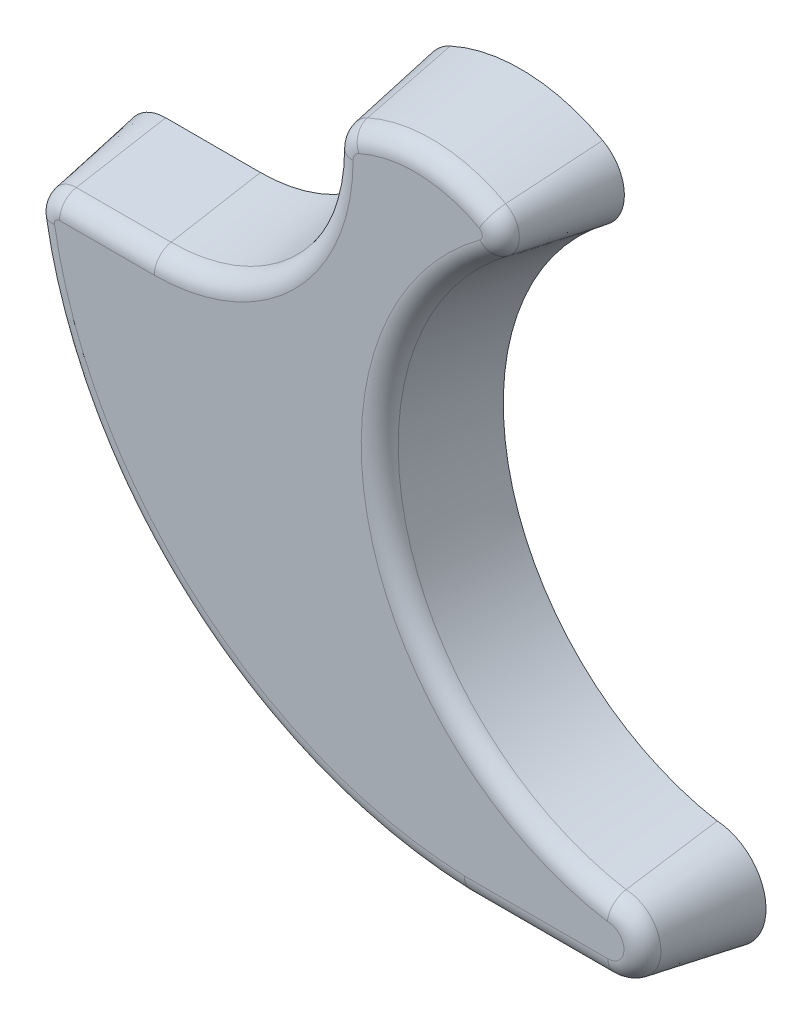
ISO-10303-21;
HEADER;
FILE_DESCRIPTION(('STEP AP214'),'2;1');
FILE_NAME('part.step','',(''),(''),'','','');
FILE_SCHEMA(('AUTOMOTIVE_DESIGN { 1 0 10303 214 1 1 1 1 }'));
ENDSEC;
DATA;
#1=APPLICATION_CONTEXT('core data for automotive mechanical design processes');
#2=APPLICATION_PROTOCOL_DEFINITION('international standard','automotive_design',2000,#1);
#3=PRODUCT_CONTEXT('',#1,'mechanical');
#4=PRODUCT('Part','Part','',(#3));
#5=PRODUCT_RELATED_PRODUCT_CATEGORY('part','',(#4));
#6=PRODUCT_DEFINITION_FORMATION('','',#4);
#7=PRODUCT_DEFINITION_CONTEXT('part definition',#1,'design');
#8=PRODUCT_DEFINITION('design','',#6,#7);
#9=PRODUCT_DEFINITION_SHAPE('','',#8);
#10=(LENGTH_UNIT() NAMED_UNIT(*) SI_UNIT(.MILLI.,.METRE.));
#11=(NAMED_UNIT(*) PLANE_ANGLE_UNIT() SI_UNIT($,.RADIAN.));
#12=(NAMED_UNIT(*) SI_UNIT($,.STERADIAN.) SOLID_ANGLE_UNIT());
#13=UNCERTAINTY_MEASURE_WITH_UNIT(LENGTH_MEASURE(1.E-05),#10,'distance_accuracy_value','');
#14=(GEOMETRIC_REPRESENTATION_CONTEXT(3) GLOBAL_UNCERTAINTY_ASSIGNED_CONTEXT((#13)) GLOBAL_UNIT_ASSIGNED_CONTEXT((#10,
#11,#12)) REPRESENTATION_CONTEXT('',''));
#15=CARTESIAN_POINT('',(0.,0.,0.));
#16=DIRECTION('',(0.,0.,1.));
#17=DIRECTION('',(1.,0.,0.));
#18=AXIS2_PLACEMENT_3D('',#15,#16,#17);
#19=CARTESIAN_POINT('',(-185.360620238029,11.7361066888979,0.));
#20=DIRECTION('',(0.,0.,-1.));
#21=DIRECTION('',(1.,0.,0.));
#22=AXIS2_PLACEMENT_3D('',#19,#20,#21);
#23=CONICAL_SURFACE('',#22,12.7,0.174532925199433);
#24=DIRECTION('',(-0.171170743391447,-0.0292278328629598,-0.984807753012208));
#25=VECTOR('',#24,1.);
#26=CARTESIAN_POINT('',(-197.879429650708,9.59848864794411,0.));
#27=LINE('',#26,#25);
#28=CARTESIAN_POINT('',(-193.052225703188,10.4227458041505,27.772665928185));
#29=VERTEX_POINT('',#28);
#30=CARTESIAN_POINT('',(-197.879429650708,9.59848864794409,0.));
#31=VERTEX_POINT('',#30);
#32=EDGE_CURVE('E157',#29,#31,#27,.T.);
#33=ORIENTED_EDGE('',*,*,#32,.F.);
#34=CARTESIAN_POINT('',(-185.360620238029,11.7361066888979,27.772665928185));
#35=DIRECTION('',(0.,0.,-1.));
#36=DIRECTION('',(-1.,0.,0.));
#37=AXIS2_PLACEMENT_3D('',#34,#35,#36);
#38=CIRCLE('',#37,7.80292967065828);
#39=CARTESIAN_POINT('',(-185.360620238029,19.5390363595562,27.772665928185));
#40=VERTEX_POINT('',#39);
#41=EDGE_CURVE('E56',#29,#40,#38,.T.);
#42=ORIENTED_EDGE('',*,*,#41,.T.);
#43=DIRECTION('',(0.,0.17364817766693,-0.984807753012208));
#44=VECTOR('',#43,1.);
#45=CARTESIAN_POINT('',(-185.360620238029,24.4361066888979,0.));
#46=LINE('',#45,#44);
#47=CARTESIAN_POINT('',(-185.360620238029,24.4361066888979,0.));
#48=VERTEX_POINT('',#47);
#49=EDGE_CURVE('E178',#40,#48,#46,.T.);
#50=ORIENTED_EDGE('',*,*,#49,.T.);
#51=CARTESIAN_POINT('',(-185.360620238029,11.7361066888979,0.));
#52=DIRECTION('',(0.,0.,1.));
#53=DIRECTION('',(1.,0.,0.));
#54=AXIS2_PLACEMENT_3D('',#51,#52,#53);
#55=CIRCLE('',#54,12.7);
#56=EDGE_CURVE('E172',#48,#31,#55,.T.);
#57=ORIENTED_EDGE('',*,*,#56,.T.);
#58=EDGE_LOOP('',(#33,#42,#50,#57));
#59=FACE_BOUND('',#58,.T.);
#60=ADVANCED_FACE('F46',(#59),#23,.T.);
#61=CARTESIAN_POINT('',(-54.3378571428572,34.1085714285715,0.));
#62=DIRECTION('',(0.,0.,-1.));
#63=DIRECTION('',(1.,0.,0.));
#64=AXIS2_PLACEMENT_3D('',#61,#62,#63);
#65=CONICAL_SURFACE('',#64,145.619116862931,0.174532925199433);
#66=CARTESIAN_POINT('',(-59.5693856344838,-105.59030612125,33.02));
#67=CARTESIAN_POINT('',(-59.5875471806484,-106.560692169269,27.5166672478581));
#68=CARTESIAN_POINT('',(-59.6056170011073,-107.531078268531,22.0133342051054));
#69=CARTESIAN_POINT('',(-59.6415731906139,-109.471850569529,11.0066675384387));
#70=CARTESIAN_POINT('',(-59.6594595596615,-110.442236771265,5.50333391452478));
#71=CARTESIAN_POINT('',(-59.6772542030036,-111.412623024244,0.));
#72=B_SPLINE_CURVE_WITH_KNOTS('',3,(#66,#67,#68,#69,#70,#71),.UNSPECIFIED.,.F.,.F.,(4,2,4),(0.,
16.7647801213005,33.5295602424167),.UNSPECIFIED.);
#73=CARTESIAN_POINT('',(-59.5866755915734,-106.515552694902,27.772665928185));
#74=VERTEX_POINT('',#73);
#75=CARTESIAN_POINT('',(-59.6772542030037,-111.412623024244,0.));
#76=VERTEX_POINT('',#75);
#77=EDGE_CURVE('E166',#74,#76,#72,.T.);
#78=ORIENTED_EDGE('',*,*,#77,.F.);
#79=CARTESIAN_POINT('',(-54.3378571428572,34.1085714285715,27.772665928185));
#80=DIRECTION('',(0.,0.,-1.));
#81=DIRECTION('',(-1.,0.,0.));
#82=AXIS2_PLACEMENT_3D('',#79,#80,#81);
#83=CIRCLE('',#82,140.722046533589);
#84=EDGE_CURVE('E64',#74,#29,#83,.T.);
#85=ORIENTED_EDGE('',*,*,#84,.T.);
#86=ORIENTED_EDGE('',*,*,#32,.T.);
#87=CARTESIAN_POINT('',(-54.3378571428572,34.1085714285715,0.));
#88=DIRECTION('',(0.,0.,1.));
#89=DIRECTION('',(1.,0.,0.));
#90=AXIS2_PLACEMENT_3D('',#87,#88,#89);
#91=CIRCLE('',#90,145.619116862931);
#92=EDGE_CURVE('E160',#31,#76,#91,.T.);
#93=ORIENTED_EDGE('',*,*,#92,.T.);
#94=EDGE_LOOP('',(#78,#85,#86,#93));
#95=FACE_BOUND('',#94,.T.);
#96=ADVANCED_FACE('F159',(#95),#65,.T.);
#97=CARTESIAN_POINT('',(-14.8204641625524,-111.412623024244,0.));
#98=DIRECTION('',(0.,-0.984807753012208,0.17364817766693));
#99=DIRECTION('',(0.,-0.17364817766693,-0.984807753012208));
#100=AXIS2_PLACEMENT_3D('',#97,#98,#99);
#101=PLANE('',#100);
#102=DIRECTION('',(0.,-0.17364817766693,-0.984807753012208));
#103=VECTOR('',#102,1.);
#104=CARTESIAN_POINT('',(-14.8204641625524,-111.412623024244,0.));
#105=LINE('',#104,#103);
#106=CARTESIAN_POINT('',(-14.8204641625524,-106.515552694902,27.772665928185));
#107=VERTEX_POINT('',#106);
#108=CARTESIAN_POINT('',(-14.8204641625524,-111.412623024244,0.));
#109=VERTEX_POINT('',#108);
#110=EDGE_CURVE('E451',#107,#109,#105,.T.);
#111=ORIENTED_EDGE('',*,*,#110,.F.);
#112=DIRECTION('',(1.,0.,0.));
#113=VECTOR('',#112,1.);
#114=CARTESIAN_POINT('',(-59.5693856344838,-106.515552694902,27.772665928185));
#115=LINE('',#114,#113);
#116=EDGE_CURVE('E72',#107,#74,#115,.F.);
#117=ORIENTED_EDGE('',*,*,#116,.T.);
#118=ORIENTED_EDGE('',*,*,#77,.T.);
#119=DIRECTION('',(1.,0.,0.));
#120=VECTOR('',#119,1.);
#121=CARTESIAN_POINT('',(-14.8204641625524,-111.412623024244,0.));
#122=LINE('',#121,#120);
#123=EDGE_CURVE('E175',#76,#109,#122,.T.);
#124=ORIENTED_EDGE('',*,*,#123,.T.);
#125=EDGE_LOOP('',(#111,#117,#118,#124));
#126=FACE_BOUND('',#125,.T.);
#127=ADVANCED_FACE('F402',(#126),#101,.T.);
#128=CARTESIAN_POINT('',(-14.8204641625524,-95.2797373334966,0.));
#129=DIRECTION('',(0.,0.,-1.));
#130=DIRECTION('',(1.,0.,0.));
#131=AXIS2_PLACEMENT_3D('',#128,#129,#130);
#132=CONICAL_SURFACE('',#131,16.1328856907471,0.174532925199433);
#133=CARTESIAN_POINT('',(-14.5084201854811,-84.9738915514478,33.02));
#134=CARTESIAN_POINT('',(-14.4576699848428,-84.4667315076806,30.1363427169767));
#135=CARTESIAN_POINT('',(-14.4055154966712,-83.9597875854176,27.2526724951651));
#136=CARTESIAN_POINT('',(-14.298771530745,-82.946275030161,21.4853126478576));
#137=CARTESIAN_POINT('',(-14.2441820542456,-82.4397063969741,18.6016230223724));
#138=CARTESIAN_POINT('',(-14.1380346976066,-81.4732580751137,13.0982834606489));
#139=CARTESIAN_POINT('',(-14.0866569393928,-81.0133506172318,10.4786349139742));
#140=CARTESIAN_POINT('',(-13.9823836772579,-80.093769615867,5.23932569271442));
#141=CARTESIAN_POINT('',(-13.9294881726286,-79.6340960724934,2.61966501812434));
#142=CARTESIAN_POINT('',(-13.8759255527134,-79.1745255210044,0.));
#143=B_SPLINE_CURVE_WITH_KNOTS('',3,(#133,#134,#135,#136,#137,#138,#139,#140,#141,#142),
.UNSPECIFIED.,.F.,.F.,(4,2,2,2,4),(0.,8.78506579771062,17.5701270661008,25.5507542714873,
33.5313852005815),.UNSPECIFIED.);
#144=CARTESIAN_POINT('',(-14.414570908634,-84.0512558020502,27.772665928185));
#145=VERTEX_POINT('',#144);
#146=CARTESIAN_POINT('',(-13.8759255527136,-79.1745255210044,0.));
#147=VERTEX_POINT('',#146);
#148=EDGE_CURVE('E448',#145,#147,#143,.T.);
#149=ORIENTED_EDGE('',*,*,#148,.F.);
#150=CARTESIAN_POINT('',(-14.8204641625524,-95.2797373334966,27.772665928185));
#151=DIRECTION('',(0.,0.,-1.));
#152=DIRECTION('',(-1.,0.,0.));
#153=AXIS2_PLACEMENT_3D('',#150,#151,#152);
#154=CIRCLE('',#153,11.2358153614054);
#155=EDGE_CURVE('E302',#145,#107,#154,.T.);
#156=ORIENTED_EDGE('',*,*,#155,.T.);
#157=ORIENTED_EDGE('',*,*,#110,.T.);
#158=CARTESIAN_POINT('',(-14.8204641625524,-95.2797373334966,0.));
#159=DIRECTION('',(0.,0.,1.));
#160=DIRECTION('',(1.,0.,0.));
#161=AXIS2_PLACEMENT_3D('',#158,#159,#160);
#162=CIRCLE('',#161,16.1328856907471);
#163=EDGE_CURVE('E186',#109,#147,#162,.T.);
#164=ORIENTED_EDGE('',*,*,#163,.T.);
#165=EDGE_LOOP('',(#149,#156,#157,#164));
#166=FACE_BOUND('',#165,.T.);
#167=ADVANCED_FACE('F427',(#166),#132,.T.);
#168=CARTESIAN_POINT('',(0.,0.,0.));
#169=DIRECTION('',(0.,0.,1.));
#170=DIRECTION('',(1.,0.,0.));
#171=AXIS2_PLACEMENT_3D('',#168,#169,#170);
#172=CONICAL_SURFACE('',#171,80.3812590186333,0.174532925199433);
#173=DIRECTION('',(0.103597979577627,-0.139359779830765,-0.984807753012208));
#174=VECTOR('',#173,1.);
#175=CARTESIAN_POINT('',(-47.9552169341434,64.5092549191189,0.));
#176=LINE('',#175,#174);
#177=CARTESIAN_POINT('',(-50.8767943372904,68.4393545728096,27.772665928185));
#178=VERTEX_POINT('',#177);
#179=CARTESIAN_POINT('',(-47.9552169341434,64.5092549191189,0.));
#180=VERTEX_POINT('',#179);
#181=EDGE_CURVE('E437',#178,#180,#176,.T.);
#182=ORIENTED_EDGE('',*,*,#181,.F.);
#183=CARTESIAN_POINT('',(0.,0.,27.772665928185));
#184=DIRECTION('',(0.,0.,1.));
#185=DIRECTION('',(1.,0.,0.));
#186=AXIS2_PLACEMENT_3D('',#183,#184,#185);
#187=CIRCLE('',#186,85.2783293479751);
#188=EDGE_CURVE('E294',#178,#145,#187,.T.);
#189=ORIENTED_EDGE('',*,*,#188,.T.);
#190=ORIENTED_EDGE('',*,*,#148,.T.);
#191=CARTESIAN_POINT('',(0.,0.,0.));
#192=DIRECTION('',(0.,0.,-1.));
#193=DIRECTION('',(1.,0.,0.));
#194=AXIS2_PLACEMENT_3D('',#191,#192,#193);
#195=CIRCLE('',#194,80.3812590186333);
#196=EDGE_CURVE('E189',#147,#180,#195,.T.);
#197=ORIENTED_EDGE('',*,*,#196,.T.);
#198=EDGE_LOOP('',(#182,#189,#190,#197));
#199=FACE_BOUND('',#198,.T.);
#200=ADVANCED_FACE('F422',(#199),#172,.F.);
#201=CARTESIAN_POINT('',(-55.6835343025102,74.9053708598825,0.));
#202=DIRECTION('',(0.,0.,-1.));
#203=DIRECTION('',(1.,0.,0.));
#204=AXIS2_PLACEMENT_3D('',#201,#202,#203);
#205=CONICAL_SURFACE('',#204,12.954,0.174532925199433);
#206=DIRECTION('',(0.083292428567465,0.152368175648262,-0.984807753012208));
#207=VECTOR('',#206,1.);
#208=CARTESIAN_POINT('',(-49.4699930252013,86.2719015880853,0.));
#209=LINE('',#208,#207);
#210=CARTESIAN_POINT('',(-51.8189314711832,81.9749508102072,27.772665928185));
#211=VERTEX_POINT('',#210);
#212=CARTESIAN_POINT('',(-49.4699930252013,86.2719015880853,0.));
#213=VERTEX_POINT('',#212);
#214=EDGE_CURVE('E430',#211,#213,#209,.T.);
#215=ORIENTED_EDGE('',*,*,#214,.F.);
#216=CARTESIAN_POINT('',(-55.6835343025102,74.9053708598825,27.772665928185));
#217=DIRECTION('',(0.,0.,-1.));
#218=DIRECTION('',(-1.,0.,0.));
#219=AXIS2_PLACEMENT_3D('',#216,#217,#218);
#220=CIRCLE('',#219,8.05692967065828);
#221=EDGE_CURVE('E292',#211,#178,#220,.T.);
#222=ORIENTED_EDGE('',*,*,#221,.T.);
#223=ORIENTED_EDGE('',*,*,#181,.T.);
#224=CARTESIAN_POINT('',(-55.6835343025102,74.9053708598825,0.));
#225=DIRECTION('',(0.,0.,1.));
#226=DIRECTION('',(1.,0.,0.));
#227=AXIS2_PLACEMENT_3D('',#224,#225,#226);
#228=CIRCLE('',#227,12.954);
#229=EDGE_CURVE('E192',#180,#213,#228,.T.);
#230=ORIENTED_EDGE('',*,*,#229,.T.);
#231=EDGE_LOOP('',(#215,#222,#223,#230));
#232=FACE_BOUND('',#231,.T.);
#233=ADVANCED_FACE('F420',(#232),#205,.T.);
#234=CARTESIAN_POINT('',(-74.9012734880693,39.7500523015337,0.));
#235=DIRECTION('',(0.,0.,-1.));
#236=DIRECTION('',(-1.,0.,0.));
#237=AXIS2_PLACEMENT_3D('',#234,#235,#236);
#238=CONICAL_SURFACE('',#237,53.0191709386489,0.174532925199433);
#239=DIRECTION('',(-0.0719851822336261,0.158024754851376,-0.984807753012208));
#240=VECTOR('',#239,1.);
#241=CARTESIAN_POINT('',(-96.8801662882858,87.9989979718617,0.));
#242=LINE('',#241,#240);
#243=CARTESIAN_POINT('',(-94.85010467287,83.5425254152162,27.772665928185));
#244=VERTEX_POINT('',#243);
#245=CARTESIAN_POINT('',(-96.8801662882858,87.9989979718617,0.));
#246=VERTEX_POINT('',#245);
#247=EDGE_CURVE('E438',#244,#246,#242,.T.);
#248=ORIENTED_EDGE('',*,*,#247,.F.);
#249=CARTESIAN_POINT('',(-74.9012734880693,39.7500523015337,27.772665928185));
#250=DIRECTION('',(0.,0.,-1.));
#251=DIRECTION('',(-1.,0.,0.));
#252=AXIS2_PLACEMENT_3D('',#249,#250,#251);
#253=CIRCLE('',#252,48.1221006093071);
#254=EDGE_CURVE('E287',#244,#211,#253,.T.);
#255=ORIENTED_EDGE('',*,*,#254,.T.);
#256=ORIENTED_EDGE('',*,*,#214,.T.);
#257=CARTESIAN_POINT('',(-74.9012734880693,39.7500523015337,0.));
#258=DIRECTION('',(0.,0.,1.));
#259=DIRECTION('',(-1.,0.,0.));
#260=AXIS2_PLACEMENT_3D('',#257,#258,#259);
#261=CIRCLE('',#260,53.0191709386489);
#262=EDGE_CURVE('E197',#213,#246,#261,.T.);
#263=ORIENTED_EDGE('',*,*,#262,.T.);
#264=EDGE_LOOP('',(#248,#255,#256,#263));
#265=FACE_BOUND('',#264,.T.);
#266=ADVANCED_FACE('F417',(#265),#238,.T.);
#267=CARTESIAN_POINT('',(-90.9836619549375,75.054755520223,0.));
#268=DIRECTION('',(0.,0.,-1.));
#269=DIRECTION('',(-1.,0.,0.));
#270=AXIS2_PLACEMENT_3D('',#267,#268,#269);
#271=CONICAL_SURFACE('',#270,14.224,0.174532925199433);
#272=DIRECTION('',(-0.173647503199055,0.000483983243590093,-0.984807753012208));
#273=VECTOR('',#272,1.);
#274=CARTESIAN_POINT('',(-105.207606707418,75.0943999193139,0.));
#275=LINE('',#274,#273);
#276=CARTESIAN_POINT('',(-100.310555398815,75.080751057495,27.772665928185));
#277=VERTEX_POINT('',#276);
#278=CARTESIAN_POINT('',(-105.207606707418,75.0943999193139,0.));
#279=VERTEX_POINT('',#278);
#280=EDGE_CURVE('E350',#277,#279,#275,.T.);
#281=ORIENTED_EDGE('',*,*,#280,.F.);
#282=CARTESIAN_POINT('',(-90.9836619549375,75.054755520223,27.772665928185));
#283=DIRECTION('',(0.,0.,-1.));
#284=DIRECTION('',(-1.,0.,0.));
#285=AXIS2_PLACEMENT_3D('',#282,#283,#284);
#286=CIRCLE('',#285,9.32692967065828);
#287=EDGE_CURVE('E281',#277,#244,#286,.T.);
#288=ORIENTED_EDGE('',*,*,#287,.T.);
#289=ORIENTED_EDGE('',*,*,#247,.T.);
#290=CARTESIAN_POINT('',(-90.9836619549375,75.054755520223,0.));
#291=DIRECTION('',(0.,0.,1.));
#292=DIRECTION('',(-1.,0.,0.));
#293=AXIS2_PLACEMENT_3D('',#290,#291,#292);
#294=CIRCLE('',#293,14.224);
#295=EDGE_CURVE('E478',#246,#279,#294,.T.);
#296=ORIENTED_EDGE('',*,*,#295,.T.);
#297=EDGE_LOOP('',(#281,#288,#289,#296));
#298=FACE_BOUND('',#297,.T.);
#299=ADVANCED_FACE('F414',(#298),#271,.T.);
#300=CARTESIAN_POINT('',(-156.007409394849,75.235987058924,0.));
#301=DIRECTION('',(0.,0.,1.));
#302=DIRECTION('',(1.,0.,0.));
#303=AXIS2_PLACEMENT_3D('',#300,#301,#302);
#304=CONICAL_SURFACE('',#303,50.8,0.174532925199433);
#305=CARTESIAN_POINT('',(-156.007409394849,75.235987058924,0.));
#306=DIRECTION('',(0.,0.,-1.));
#307=DIRECTION('',(1.,0.,0.));
#308=AXIS2_PLACEMENT_3D('',#305,#306,#307);
#309=CIRCLE('',#308,50.8);
#310=CARTESIAN_POINT('',(-155.897162440074,24.4361066888979,0.));
#311=VERTEX_POINT('',#310);
#312=EDGE_CURVE('E651',#279,#311,#309,.T.);
#313=ORIENTED_EDGE('',*,*,#312,.T.);
#314=DIRECTION('',(0.,0.17364817766693,-0.984807753012208));
#315=VECTOR('',#314,1.);
#316=CARTESIAN_POINT('',(-155.897162440074,24.4361066888979,0.));
#317=LINE('',#316,#315);
#318=CARTESIAN_POINT('',(-155.897162440074,19.5390363595562,27.772665928185));
#319=VERTEX_POINT('',#318);
#320=EDGE_CURVE('E349',#319,#311,#317,.T.);
#321=ORIENTED_EDGE('',*,*,#320,.F.);
#322=CARTESIAN_POINT('',(-155.897162419882,19.5390261584773,27.772664129456));
#323=CARTESIAN_POINT('',(-155.896946103333,19.5390265734407,27.7726642044031));
#324=CARTESIAN_POINT('',(-155.896729786787,19.5390269896643,27.7726642793501));
#325=CARTESIAN_POINT('',(-155.8962971537,19.5390278246318,27.7726644292442));
#326=CARTESIAN_POINT('',(-155.896080837158,19.5390282433757,27.7726645041912));
#327=CARTESIAN_POINT('',(-155.89564820408,19.539029083384,27.7726646540853));
#328=CARTESIAN_POINT('',(-155.895431887544,19.5390295046484,27.7726647290324));
#329=CARTESIAN_POINT('',(-155.894999254475,19.5390303496975,27.7726648789264));
#330=CARTESIAN_POINT('',(-155.894782937943,19.5390307734823,27.7726649538735));
#331=CARTESIAN_POINT('',(-155.894350304884,19.5390316235722,27.7726651037676));
#332=CARTESIAN_POINT('',(-155.894133988357,19.5390320498773,27.7726651787146));
#333=CARTESIAN_POINT('',(-155.893701355308,19.539032905008,27.7726653286087));
#334=CARTESIAN_POINT('',(-155.893485038785,19.5390333338336,27.7726654035557));
#335=CARTESIAN_POINT('',(-155.893052405746,19.5390341940051,27.7726655534498));
#336=CARTESIAN_POINT('',(-155.892836089228,19.539034625351,27.7726656283968));
#337=CARTESIAN_POINT('',(-155.892403456199,19.5390354905633,27.7726657782909));
#338=CARTESIAN_POINT('',(-155.892187139686,19.5390359244297,27.772665853238));
#339=CARTESIAN_POINT('',(-155.891970823176,19.5390363595562,27.772665928185));
#340=B_SPLINE_CURVE_WITH_KNOTS('',3,(#322,#323,#324,#325,#326,#327,#328,#329,#330,#331,#332,
#333,#334,#335,#336,#337,#338,#339),.UNSPECIFIED.,.F.,.F.,(4,2,2,2,2,2,2,2,4),(0.,
0.000648950878562804,0.00129790175753535,0.00194685263697801,0.00259580351692334,
0.0032447543973207,0.00389370527814713,0.00454265615943524,0.00519160704124536),.UNSPECIFIED.);
#341=CARTESIAN_POINT('',(-155.891970823176,19.5390363595562,27.772665928185));
#342=VERTEX_POINT('',#341);
#343=EDGE_CURVE('E12',#319,#342,#340,.T.);
#344=ORIENTED_EDGE('',*,*,#343,.T.);
#345=CARTESIAN_POINT('',(-156.007409394849,75.235987058924,27.772665928185));
#346=DIRECTION('',(0.,0.,1.));
#347=DIRECTION('',(1.,0.,0.));
#348=AXIS2_PLACEMENT_3D('',#345,#346,#347);
#349=CIRCLE('',#348,55.6970703293417);
#350=EDGE_CURVE('E296',#342,#277,#349,.T.);
#351=ORIENTED_EDGE('',*,*,#350,.T.);
#352=ORIENTED_EDGE('',*,*,#280,.T.);
#353=EDGE_LOOP('',(#313,#321,#344,#351,#352));
#354=FACE_BOUND('',#353,.T.);
#355=ADVANCED_FACE('F410',(#354),#304,.F.);
#356=CARTESIAN_POINT('',(-185.360620238029,24.4361066888979,0.));
#357=DIRECTION('',(0.,0.984807753012208,0.17364817766693));
#358=DIRECTION('',(0.,-0.17364817766693,0.984807753012208));
#359=AXIS2_PLACEMENT_3D('',#356,#357,#358);
#360=PLANE('',#359);
#361=ORIENTED_EDGE('',*,*,#49,.F.);
#362=DIRECTION('',(-1.,0.,0.));
#363=VECTOR('',#362,1.);
#364=CARTESIAN_POINT('',(-155.897162440074,19.5390363595562,27.772665928185));
#365=LINE('',#364,#363);
#366=EDGE_CURVE('E348',#40,#319,#365,.F.);
#367=ORIENTED_EDGE('',*,*,#366,.T.);
#368=ORIENTED_EDGE('',*,*,#320,.T.);
#369=DIRECTION('',(-1.,0.,0.));
#370=VECTOR('',#369,1.);
#371=CARTESIAN_POINT('',(-185.360620238029,24.4361066888979,0.));
#372=LINE('',#371,#370);
#373=EDGE_CURVE('E647',#311,#48,#372,.T.);
#374=ORIENTED_EDGE('',*,*,#373,.T.);
#375=EDGE_LOOP('',(#361,#367,#368,#374));
#376=FACE_BOUND('',#375,.T.);
#377=ADVANCED_FACE('F407',(#376),#360,.T.);
#378=CARTESIAN_POINT('',(-185.360620238029,11.7361066888979,33.02));
#379=DIRECTION('',(0.,0.,1.));
#380=DIRECTION('',(1.,0.,0.));
#381=AXIS2_PLACEMENT_3D('',#378,#379,#380);
#382=PLANE('',#381);
#383=CARTESIAN_POINT('',(-156.007409394849,75.235987058924,33.02));
#384=DIRECTION('',(0.,0.,1.));
#385=DIRECTION('',(1.,0.,0.));
#386=AXIS2_PLACEMENT_3D('',#383,#384,#385);
#387=CIRCLE('',#386,61.9505995609693);
#388=CARTESIAN_POINT('',(-94.0570504565561,75.0633215433931,33.02));
#389=VERTEX_POINT('',#388);
#390=CARTESIAN_POINT('',(-155.885662596501,13.2855071279287,33.02));
#391=VERTEX_POINT('',#390);
#392=EDGE_CURVE('E341',#389,#391,#387,.F.);
#393=ORIENTED_EDGE('',*,*,#392,.T.);
#394=DIRECTION('',(1.,0.,0.));
#395=VECTOR('',#394,1.);
#396=CARTESIAN_POINT('',(-185.360620238029,13.2855071279287,33.02));
#397=LINE('',#396,#395);
#398=CARTESIAN_POINT('',(-185.360620238029,13.2855071279287,33.02));
#399=VERTEX_POINT('',#398);
#400=EDGE_CURVE('E344',#391,#399,#397,.F.);
#401=ORIENTED_EDGE('',*,*,#400,.T.);
#402=CARTESIAN_POINT('',(-185.360620238029,11.7361066888979,33.02));
#403=DIRECTION('',(0.,0.,1.));
#404=DIRECTION('',(1.,0.,0.));
#405=AXIS2_PLACEMENT_3D('',#402,#403,#404);
#406=CIRCLE('',#405,1.54940043903076);
#407=CARTESIAN_POINT('',(-186.887915419143,11.4753172140055,33.02));
#408=VERTEX_POINT('',#407);
#409=EDGE_CURVE('E165',#399,#408,#406,.T.);
#410=ORIENTED_EDGE('',*,*,#409,.T.);
#411=CARTESIAN_POINT('',(-54.3378571428572,34.1085714285715,33.02));
#412=DIRECTION('',(0.,0.,1.));
#413=DIRECTION('',(1.,0.,0.));
#414=AXIS2_PLACEMENT_3D('',#411,#412,#413);
#415=CIRCLE('',#414,134.468517301962);
#416=CARTESIAN_POINT('',(-59.4686829827589,-100.262023463274,33.02));
#417=VERTEX_POINT('',#416);
#418=EDGE_CURVE('E314',#408,#417,#415,.T.);
#419=ORIENTED_EDGE('',*,*,#418,.T.);
#420=DIRECTION('',(-1.,0.,0.));
#421=VECTOR('',#420,1.);
#422=CARTESIAN_POINT('',(-14.8204641625524,-100.262023463274,33.02));
#423=LINE('',#422,#421);
#424=CARTESIAN_POINT('',(-14.8204641625524,-100.262023463274,33.02));
#425=VERTEX_POINT('',#424);
#426=EDGE_CURVE('E320',#417,#425,#423,.F.);
#427=ORIENTED_EDGE('',*,*,#426,.T.);
#428=CARTESIAN_POINT('',(-14.8204641625524,-95.2797373334966,33.02));
#429=DIRECTION('',(0.,0.,1.));
#430=DIRECTION('',(1.,0.,0.));
#431=AXIS2_PLACEMENT_3D('',#428,#429,#430);
#432=CIRCLE('',#431,4.98228612977788);
#433=CARTESIAN_POINT('',(-14.9684485218816,-90.2996494117455,33.02));
#434=VERTEX_POINT('',#433);
#435=EDGE_CURVE('E322',#425,#434,#432,.T.);
#436=ORIENTED_EDGE('',*,*,#435,.T.);
#437=CARTESIAN_POINT('',(0.,0.,33.02));
#438=DIRECTION('',(0.,0.,1.));
#439=DIRECTION('',(1.,0.,0.));
#440=AXIS2_PLACEMENT_3D('',#437,#438,#439);
#441=CIRCLE('',#440,91.5318585796026);
#442=CARTESIAN_POINT('',(-54.6076310344014,73.4580680922596,33.02));
#443=VERTEX_POINT('',#442);
#444=EDGE_CURVE('E326',#434,#443,#441,.F.);
#445=ORIENTED_EDGE('',*,*,#444,.T.);
#446=CARTESIAN_POINT('',(-55.6835343025102,74.9053708598825,33.02));
#447=DIRECTION('',(0.,0.,1.));
#448=DIRECTION('',(1.,0.,0.));
#449=AXIS2_PLACEMENT_3D('',#446,#447,#448);
#450=CIRCLE('',#449,1.80340043903076);
#451=CARTESIAN_POINT('',(-54.8185116788083,76.4877706209986,33.02));
#452=VERTEX_POINT('',#451);
#453=EDGE_CURVE('E329',#443,#452,#450,.T.);
#454=ORIENTED_EDGE('',*,*,#453,.T.);
#455=CARTESIAN_POINT('',(-74.9012734880693,39.7500523015337,33.02));
#456=DIRECTION('',(0.,0.,1.));
#457=DIRECTION('',(1.,0.,0.));
#458=AXIS2_PLACEMENT_3D('',#455,#456,#457);
#459=CIRCLE('',#458,41.8685713776796);
#460=CARTESIAN_POINT('',(-92.2577282518202,77.8516368780539,33.02));
#461=VERTEX_POINT('',#460);
#462=EDGE_CURVE('E286',#452,#461,#459,.T.);
#463=ORIENTED_EDGE('',*,*,#462,.T.);
#464=CARTESIAN_POINT('',(-90.9836619549375,75.054755520223,33.02));
#465=DIRECTION('',(0.,0.,1.));
#466=DIRECTION('',(1.,0.,0.));
#467=AXIS2_PLACEMENT_3D('',#464,#465,#466);
#468=CIRCLE('',#467,3.07340043903076);
#469=EDGE_CURVE('E283',#461,#389,#468,.T.);
#470=ORIENTED_EDGE('',*,*,#469,.T.);
#471=EDGE_LOOP('',(#393,#401,#410,#419,#427,#436,#445,#454,#463,#470));
#472=FACE_BOUND('',#471,.T.);
#473=ADVANCED_FACE('F409',(#472),#382,.T.);
#474=CARTESIAN_POINT('',(-185.360620238029,11.7361066888979,0.));
#475=DIRECTION('',(0.,0.,1.));
#476=DIRECTION('',(1.,0.,0.));
#477=AXIS2_PLACEMENT_3D('',#474,#475,#476);
#478=PLANE('',#477);
#479=ORIENTED_EDGE('',*,*,#56,.F.);
#480=ORIENTED_EDGE('',*,*,#373,.F.);
#481=ORIENTED_EDGE('',*,*,#312,.F.);
#482=ORIENTED_EDGE('',*,*,#295,.F.);
#483=ORIENTED_EDGE('',*,*,#262,.F.);
#484=ORIENTED_EDGE('',*,*,#229,.F.);
#485=ORIENTED_EDGE('',*,*,#196,.F.);
#486=ORIENTED_EDGE('',*,*,#163,.F.);
#487=ORIENTED_EDGE('',*,*,#123,.F.);
#488=ORIENTED_EDGE('',*,*,#92,.F.);
#489=EDGE_LOOP('',(#479,#480,#481,#482,#483,#484,#485,#486,#487,#488));
#490=FACE_BOUND('',#489,.T.);
#491=ADVANCED_FACE('F170',(#490),#478,.F.);
#492=CARTESIAN_POINT('',(0.,0.,26.67));
#493=DIRECTION('',(0.,0.,1.));
#494=DIRECTION('',(1.,0.,0.));
#495=AXIS2_PLACEMENT_3D('',#492,#493,#494);
#496=TOROIDAL_SURFACE('',#495,91.5318585796026,6.35);
#497=CARTESIAN_POINT('',(-14.414570908634,-84.0512558020505,27.772665928185));
#498=CARTESIAN_POINT('',(-14.4177592673173,-84.0821159078152,27.9483322911613));
#499=CARTESIAN_POINT('',(-14.4217114335728,-84.120391067689,28.1226781887803));
#500=CARTESIAN_POINT('',(-14.4310837832463,-84.2114138885737,28.4675003173588));
#501=CARTESIAN_POINT('',(-14.4365038874961,-84.2641607691029,28.6379767564672));
#502=CARTESIAN_POINT('',(-14.4487486173495,-84.383731283725,28.9737337794432));
#503=CARTESIAN_POINT('',(-14.4555722646661,-84.4505451137397,29.1390178904232));
#504=CARTESIAN_POINT('',(-14.470545828857,-84.5977885430074,29.4633408378647));
#505=CARTESIAN_POINT('',(-14.4786957314026,-84.6782179951591,29.6223797417757));
#506=CARTESIAN_POINT('',(-14.4962291761731,-84.8521471296292,29.9331315934658));
#507=CARTESIAN_POINT('',(-14.5056130747983,-84.945650588453,30.084842407385));
#508=CARTESIAN_POINT('',(-14.5255055013167,-85.1450809751672,30.3798694580326));
#509=CARTESIAN_POINT('',(-14.5360144420058,-85.2510124644767,30.5231825834654));
#510=CARTESIAN_POINT('',(-14.5580231119831,-85.4744596552856,30.8002684164887));
#511=CARTESIAN_POINT('',(-14.5695223222468,-85.5919692929932,30.9340460554653));
#512=CARTESIAN_POINT('',(-14.5933780546526,-85.8377880192438,31.1912038645786));
#513=CARTESIAN_POINT('',(-14.6057345964772,-85.9660973557392,31.3145837958622));
#514=CARTESIAN_POINT('',(-14.6311660019643,-86.2327308393104,31.5501881395685));
#515=CARTESIAN_POINT('',(-14.6442415355269,-86.3710643656195,31.6624018650888));
#516=CARTESIAN_POINT('',(-14.6709376071249,-86.6566586125537,31.8747540734807));
#517=CARTESIAN_POINT('',(-14.6845581453964,-86.8039193370466,31.9748925511204));
#518=CARTESIAN_POINT('',(-14.7121817962223,-87.1064415567775,32.1624665010515));
#519=CARTESIAN_POINT('',(-14.7261851908015,-87.261709028966,32.2498922919252));
#520=CARTESIAN_POINT('',(-14.7543817459822,-87.5790419033314,32.4113411482137));
#521=CARTESIAN_POINT('',(-14.7685749031546,-87.7411071827797,32.4853644554707));
#522=CARTESIAN_POINT('',(-14.7970094522116,-88.0714682669342,32.6197325822411));
#523=CARTESIAN_POINT('',(-14.8112508405275,-88.2397837447005,32.680029033449));
#524=CARTESIAN_POINT('',(-14.8395264926467,-88.5808577046778,32.7861792600713));
#525=CARTESIAN_POINT('',(-14.8535608315701,-88.7536145098547,32.8320384027931));
#526=CARTESIAN_POINT('',(-14.8811903506975,-89.1020406214465,32.9089545537466));
#527=CARTESIAN_POINT('',(-14.89478638582,-89.2777031015817,32.940042235935));
#528=CARTESIAN_POINT('',(-14.9213504145632,-89.6309897725509,32.987342442525));
#529=CARTESIAN_POINT('',(-14.9343187422915,-89.8086128565911,33.0035629645519));
#530=CARTESIAN_POINT('',(-14.9533612524082,-90.0788044905226,33.016845502827));
#531=CARTESIAN_POINT('',(-14.9597460391744,-90.1711105988257,33.0193732005778));
#532=CARTESIAN_POINT('',(-14.9668192813727,-90.275504338825,33.0199657358755));
#533=CARTESIAN_POINT('',(-14.9676350261957,-90.2875768340539,33.0199999965644));
#534=CARTESIAN_POINT('',(-14.9684485218815,-90.2996494117455,33.02));
#535=B_SPLINE_CURVE_WITH_KNOTS('',3,(#497,#498,#499,#500,#501,#502,#503,#504,#505,#506,#507,
#508,#509,#510,#511,#512,#513,#514,#515,#516,#517,#518,#519,#520,#521,#522,#523,#524,#525,#526,
#527,#528,#529,#530,#531,#532,#533,#534),.UNSPECIFIED.,.F.,.F.,(4,2,2,2,2,2,2,2,2,2,2,2,2,2,2,2,
2,2,4),(0.,0.534990656724158,1.06995246626965,1.60454265669909,2.13912707186061,
2.67386622518266,3.20880225968921,3.74345960793111,4.27812923482547,4.81330575614997,
5.34848250934251,5.88406471850095,6.41963726234172,6.95706872012256,7.49430014230473,
8.03041103741941,8.56623336802646,8.84383522111344,8.88013525582984),.UNSPECIFIED.);
#536=EDGE_CURVE('E183',#145,#434,#535,.T.);
#537=ORIENTED_EDGE('',*,*,#536,.F.);
#538=ORIENTED_EDGE('',*,*,#188,.F.);
#539=CARTESIAN_POINT('',(-54.6076310344014,73.4580680922596,26.67));
#540=DIRECTION('',(0.802540986626806,0.596596986904956,0.));
#541=DIRECTION('',(-0.596596986904956,0.802540986626806,0.));
#542=AXIS2_PLACEMENT_3D('',#539,#540,#541);
#543=CIRCLE('',#542,6.35);
#544=EDGE_CURVE('E50',#443,#178,#543,.T.);
#545=ORIENTED_EDGE('',*,*,#544,.F.);
#546=ORIENTED_EDGE('',*,*,#444,.F.);
#547=EDGE_LOOP('',(#537,#538,#545,#546));
#548=FACE_BOUND('',#547,.T.);
#549=ADVANCED_FACE('F244',(#548),#496,.T.);
#550=CARTESIAN_POINT('',(-55.6835343025102,74.9053708598825,26.67));
#551=DIRECTION('',(0.,0.,1.));
#552=DIRECTION('',(1.,0.,0.));
#553=AXIS2_PLACEMENT_3D('',#550,#551,#552);
#554=DEGENERATE_TOROIDAL_SURFACE('',#553,1.80340043903076,6.35,.T.);
#555=ORIENTED_EDGE('',*,*,#544,.T.);
#556=ORIENTED_EDGE('',*,*,#221,.F.);
#557=CARTESIAN_POINT('',(-54.8185116788083,76.4877706209986,26.67));
#558=DIRECTION('',(-0.877453352493654,0.479661979103668,0.));
#559=DIRECTION('',(-0.479661979103668,-0.877453352493654,0.));
#560=AXIS2_PLACEMENT_3D('',#557,#558,#559);
#561=CIRCLE('',#560,6.35);
#562=EDGE_CURVE('E256',#452,#211,#561,.T.);
#563=ORIENTED_EDGE('',*,*,#562,.F.);
#564=ORIENTED_EDGE('',*,*,#453,.F.);
#565=EDGE_LOOP('',(#555,#556,#563,#564));
#566=FACE_BOUND('',#565,.T.);
#567=ADVANCED_FACE('F48',(#566),#554,.T.);
#568=CARTESIAN_POINT('',(-14.8204641625524,-95.2797373334966,26.67));
#569=DIRECTION('',(0.,0.,1.));
#570=DIRECTION('',(1.,0.,0.));
#571=AXIS2_PLACEMENT_3D('',#568,#569,#570);
#572=DEGENERATE_TOROIDAL_SURFACE('',#571,4.98228612977788,6.35,.T.);
#573=ORIENTED_EDGE('',*,*,#536,.T.);
#574=ORIENTED_EDGE('',*,*,#435,.F.);
#575=CARTESIAN_POINT('',(-14.8204641625524,-100.262023463274,26.67));
#576=DIRECTION('',(-1.,0.,0.));
#577=DIRECTION('',(0.,-1.,0.));
#578=AXIS2_PLACEMENT_3D('',#575,#576,#577);
#579=CIRCLE('',#578,6.35);
#580=EDGE_CURVE('E265',#107,#425,#579,.T.);
#581=ORIENTED_EDGE('',*,*,#580,.F.);
#582=ORIENTED_EDGE('',*,*,#155,.F.);
#583=EDGE_LOOP('',(#573,#574,#581,#582));
#584=FACE_BOUND('',#583,.T.);
#585=ADVANCED_FACE('F242',(#584),#572,.T.);
#586=CARTESIAN_POINT('',(-74.9012734880693,39.7500523015337,26.67));
#587=DIRECTION('',(0.,0.,1.));
#588=DIRECTION('',(1.,0.,0.));
#589=AXIS2_PLACEMENT_3D('',#586,#587,#588);
#590=TOROIDAL_SURFACE('',#589,41.8685713776796,6.35);
#591=ORIENTED_EDGE('',*,*,#562,.T.);
#592=ORIENTED_EDGE('',*,*,#254,.F.);
#593=CARTESIAN_POINT('',(-92.2577282518202,77.8516368780539,26.67));
#594=DIRECTION('',(-0.910028293844113,-0.41454614267072,0.));
#595=DIRECTION('',(0.41454614267072,-0.910028293844113,0.));
#596=AXIS2_PLACEMENT_3D('',#593,#594,#595);
#597=CIRCLE('',#596,6.35);
#598=EDGE_CURVE('E222',#461,#244,#597,.T.);
#599=ORIENTED_EDGE('',*,*,#598,.F.);
#600=ORIENTED_EDGE('',*,*,#462,.F.);
#601=EDGE_LOOP('',(#591,#592,#599,#600));
#602=FACE_BOUND('',#601,.T.);
#603=ADVANCED_FACE('F235',(#602),#590,.T.);
#604=CARTESIAN_POINT('',(-185.360620238029,-100.262023463274,26.67));
#605=DIRECTION('',(1.,0.,0.));
#606=DIRECTION('',(0.,1.,0.));
#607=AXIS2_PLACEMENT_3D('',#604,#605,#606);
#608=CYLINDRICAL_SURFACE('',#607,6.35);
#609=ORIENTED_EDGE('',*,*,#580,.T.);
#610=ORIENTED_EDGE('',*,*,#426,.F.);
#611=CARTESIAN_POINT('',(-59.5866755915739,-106.515552694902,27.772665928185));
#612=CARTESIAN_POINT('',(-59.5860974288293,-106.484563242978,27.9485264773129));
#613=CARTESIAN_POINT('',(-59.585380140419,-106.446119317841,28.1230692988006));
#614=CARTESIAN_POINT('',(-59.5836735587422,-106.354680301208,28.468290929414));
#615=CARTESIAN_POINT('',(-59.5826842786462,-106.301685914289,28.6389699252043));
#616=CARTESIAN_POINT('',(-59.5804405487044,-106.181535267769,28.9751558470135));
#617=CARTESIAN_POINT('',(-59.5791862517908,-106.114387175846,29.1406656930186));
#618=CARTESIAN_POINT('',(-59.5764206252982,-105.966395138876,29.4654398098994));
#619=CARTESIAN_POINT('',(-59.5749092987355,-105.885551354554,29.6247041540414));
#620=CARTESIAN_POINT('',(-59.5716391048538,-105.710710607567,29.9359111057764));
#621=CARTESIAN_POINT('',(-59.5698801525655,-105.616709130093,30.0878511760252));
#622=CARTESIAN_POINT('',(-59.5661262018494,-105.416206399743,30.3833254928629));
#623=CARTESIAN_POINT('',(-59.5641311169885,-105.309700569933,30.526856632558));
#624=CARTESIAN_POINT('',(-59.5599201860375,-105.085047108918,30.8043426936679));
#625=CARTESIAN_POINT('',(-59.5577044824325,-104.966906992171,30.9383037010852));
#626=CARTESIAN_POINT('',(-59.5530661307564,-104.719765107949,31.1958022755714));
#627=CARTESIAN_POINT('',(-59.5506434784418,-104.590763117755,31.3193396288039));
#628=CARTESIAN_POINT('',(-59.5456083151165,-104.322851505469,31.5550798010904));
#629=CARTESIAN_POINT('',(-59.5429958540156,-104.183944488053,31.6672855813366));
#630=CARTESIAN_POINT('',(-59.5375983182107,-103.89718322227,31.8796008208676));
#631=CARTESIAN_POINT('',(-59.5348132474172,-103.749329176595,31.9797105540302));
#632=CARTESIAN_POINT('',(-59.5290859941614,-103.445538751264,32.1672384701081));
#633=CARTESIAN_POINT('',(-59.5261436289488,-103.289592976803,32.2546414313872));
#634=CARTESIAN_POINT('',(-59.5201250906361,-102.970893814711,32.4159921641256));
#635=CARTESIAN_POINT('',(-59.5170489152034,-102.808140308411,32.4899397009182));
#636=CARTESIAN_POINT('',(-59.5104631772159,-102.460026298279,32.6307080321921));
#637=CARTESIAN_POINT('',(-59.5069414704524,-102.274056264461,32.6960260799868));
#638=CARTESIAN_POINT('',(-59.4997922856013,-101.896929338371,32.8090813300219));
#639=CARTESIAN_POINT('',(-59.4961648486387,-101.705774464763,32.8568252719909));
#640=CARTESIAN_POINT('',(-59.4888429696399,-101.320350233703,32.934263315589));
#641=CARTESIAN_POINT('',(-59.4851487161182,-101.126089777364,32.9640018938146));
#642=CARTESIAN_POINT('',(-59.4777176585651,-100.735758433177,33.0053404400575));
#643=CARTESIAN_POINT('',(-59.4739808915026,-100.539689142695,33.0169551102991));
#644=CARTESIAN_POINT('',(-59.4697208020628,-100.316406036545,33.0198255826292));
#645=CARTESIAN_POINT('',(-59.4692019115544,-100.289213679037,33.0200002882944));
#646=CARTESIAN_POINT('',(-59.4686829827586,-100.262023463274,33.02));
#647=B_SPLINE_CURVE_WITH_KNOTS('',3,(#611,#612,#613,#614,#615,#616,#617,#618,#619,#620,#621,
#622,#623,#624,#625,#626,#627,#628,#629,#630,#631,#632,#633,#634,#635,#636,#637,#638,#639,#640,
#641,#642,#643,#644,#645,#646),.UNSPECIFIED.,.F.,.F.,(4,2,2,2,2,2,2,2,2,2,2,2,2,2,2,2,2,4),(0.,
0.535549501573734,1.07107307485056,1.60628845550129,2.14149755562922,2.67689075472466,
3.21248053689642,3.74772662846326,4.28298369768811,4.81810052840275,5.35320524076527,
5.8889457727997,6.42469564741523,7.01524788434567,7.60557340596331,8.19443470034397,
8.7828180580722,8.86440910128545),.UNSPECIFIED.);
#648=EDGE_CURVE('E210',#74,#417,#647,.T.);
#649=ORIENTED_EDGE('',*,*,#648,.F.);
#650=ORIENTED_EDGE('',*,*,#116,.F.);
#651=EDGE_LOOP('',(#609,#610,#649,#650));
#652=FACE_BOUND('',#651,.T.);
#653=ADVANCED_FACE('F230',(#652),#608,.T.);
#654=CARTESIAN_POINT('',(-90.9836619549375,75.054755520223,26.67));
#655=DIRECTION('',(0.,0.,1.));
#656=DIRECTION('',(1.,0.,0.));
#657=AXIS2_PLACEMENT_3D('',#654,#655,#656);
#658=DEGENERATE_TOROIDAL_SURFACE('',#657,3.07340043903076,6.35,.T.);
#659=ORIENTED_EDGE('',*,*,#598,.T.);
#660=ORIENTED_EDGE('',*,*,#287,.F.);
#661=CARTESIAN_POINT('',(-94.0570504565561,75.0633215433931,26.67));
#662=DIRECTION('',(-0.00278714841752191,-0.999996115894306,0.));
#663=DIRECTION('',(0.999996115894306,-0.00278714841752191,0.));
#664=AXIS2_PLACEMENT_3D('',#661,#662,#663);
#665=CIRCLE('',#664,6.35);
#666=EDGE_CURVE('E223',#389,#277,#665,.T.);
#667=ORIENTED_EDGE('',*,*,#666,.F.);
#668=ORIENTED_EDGE('',*,*,#469,.F.);
#669=EDGE_LOOP('',(#659,#660,#667,#668));
#670=FACE_BOUND('',#669,.T.);
#671=ADVANCED_FACE('F234',(#670),#658,.T.);
#672=CARTESIAN_POINT('',(-54.3378571428572,34.1085714285715,26.67));
#673=DIRECTION('',(0.,0.,1.));
#674=DIRECTION('',(1.,0.,0.));
#675=AXIS2_PLACEMENT_3D('',#672,#673,#674);
#676=TOROIDAL_SURFACE('',#675,134.468517301962,6.35);
#677=ORIENTED_EDGE('',*,*,#648,.T.);
#678=ORIENTED_EDGE('',*,*,#418,.F.);
#679=CARTESIAN_POINT('',(-186.887915419143,11.4753172140055,26.67));
#680=DIRECTION('',(-0.168316381177468,0.98573302462042,0.));
#681=DIRECTION('',(-0.98573302462042,-0.168316381177468,0.));
#682=AXIS2_PLACEMENT_3D('',#679,#680,#681);
#683=CIRCLE('',#682,6.35);
#684=EDGE_CURVE('E380',#29,#408,#683,.T.);
#685=ORIENTED_EDGE('',*,*,#684,.F.);
#686=ORIENTED_EDGE('',*,*,#84,.F.);
#687=EDGE_LOOP('',(#677,#678,#685,#686));
#688=FACE_BOUND('',#687,.T.);
#689=ADVANCED_FACE('F227',(#688),#676,.T.);
#690=CARTESIAN_POINT('',(-156.007409394849,75.235987058924,26.67));
#691=DIRECTION('',(0.,0.,1.));
#692=DIRECTION('',(1.,0.,0.));
#693=AXIS2_PLACEMENT_3D('',#690,#691,#692);
#694=TOROIDAL_SURFACE('',#693,61.9505995609693,6.35);
#695=ORIENTED_EDGE('',*,*,#666,.T.);
#696=ORIENTED_EDGE('',*,*,#350,.F.);
#697=CARTESIAN_POINT('',(-155.891970823176,19.5390363595562,27.772665928185));
#698=CARTESIAN_POINT('',(-155.891938707336,19.5080430335196,27.9485483869077));
#699=CARTESIAN_POINT('',(-155.891898872227,19.4695933210977,28.1231132760149));
#700=CARTESIAN_POINT('',(-155.891804193259,19.3781385926021,28.468379236041));
#701=CARTESIAN_POINT('',(-155.891749350117,19.3251342716278,28.639080491058));
#702=CARTESIAN_POINT('',(-155.89162512307,19.2049647594316,28.9752956424053));
#703=CARTESIAN_POINT('',(-155.891555748863,19.1378090139226,29.140812914686));
#704=CARTESIAN_POINT('',(-155.89140301539,18.9897994015509,29.4656025104439));
#705=CARTESIAN_POINT('',(-155.891319656295,18.9089457023871,29.6248749103452));
#706=CARTESIAN_POINT('',(-155.891139603045,18.7340852625779,29.9360933420321));
#707=CARTESIAN_POINT('',(-155.891042904751,18.6400744392056,30.0880370799398));
#708=CARTESIAN_POINT('',(-155.8908369394,18.4395504816875,30.3835196852245));
#709=CARTESIAN_POINT('',(-155.890727667724,18.3330327515016,30.5270554336063));
#710=CARTESIAN_POINT('',(-155.890497537425,18.1083524824756,30.8045512113155));
#711=CARTESIAN_POINT('',(-155.890376686264,17.9901974400197,30.9385173103724));
#712=CARTESIAN_POINT('',(-155.890124256805,17.7429821090902,31.196067793138));
#713=CARTESIAN_POINT('',(-155.889992674801,17.6139180537733,31.3196485612126));
#714=CARTESIAN_POINT('',(-155.889719898522,17.3458772887919,31.5554629683929));
#715=CARTESIAN_POINT('',(-155.889578707091,17.2069035118583,31.6676999410611));
#716=CARTESIAN_POINT('',(-155.889287778751,16.9199970663498,31.8800707207296));
#717=CARTESIAN_POINT('',(-155.889138041846,16.7720644006547,31.9802045316205));
#718=CARTESIAN_POINT('',(-155.888831069312,16.4681843743909,32.1677236206402));
#719=CARTESIAN_POINT('',(-155.888673828464,16.3122314288845,32.2550998479024));
#720=CARTESIAN_POINT('',(-155.888353201853,15.9935721846822,32.4163692107639));
#721=CARTESIAN_POINT('',(-155.888189818313,15.8308683259438,32.4902671665483));
#722=CARTESIAN_POINT('',(-155.88786274904,15.5044676238131,32.6222119190012));
#723=CARTESIAN_POINT('',(-155.887699200693,15.3409270341512,32.6806456421584));
#724=CARTESIAN_POINT('',(-155.887368621873,15.0096696473477,32.7839061719763));
#725=CARTESIAN_POINT('',(-155.887201592712,14.8419544201585,32.8287380126667));
#726=CARTESIAN_POINT('',(-155.886865447768,14.5037132866437,32.9044576325091));
#727=CARTESIAN_POINT('',(-155.886696336101,14.333192752383,32.9353694317532));
#728=CARTESIAN_POINT('',(-155.886356945772,13.9902478231777,32.9831440737711));
#729=CARTESIAN_POINT('',(-155.886186667548,13.8178241288682,33.0000119227097));
#730=CARTESIAN_POINT('',(-155.885898388892,13.5252980739857,33.016606255581));
#731=CARTESIAN_POINT('',(-155.885780398834,13.4053951985388,33.0200068000208));
#732=CARTESIAN_POINT('',(-155.885662596505,13.2855071279287,33.02));
#733=B_SPLINE_CURVE_WITH_KNOTS('',3,(#697,#698,#699,#700,#701,#702,#703,#704,#705,#706,#707,
#708,#709,#710,#711,#712,#713,#714,#715,#716,#717,#718,#719,#720,#721,#722,#723,#724,#725,#726,
#727,#728,#729,#730,#731,#732),.UNSPECIFIED.,.F.,.F.,(4,2,2,2,2,2,2,2,2,2,2,2,2,2,2,2,2,4),(0.,
0.535613506838527,1.07120143828195,1.60643300450133,2.14165801855119,2.67704948559141,
3.2126383177825,3.74788436961507,4.28331600098635,4.81858982657803,5.35386348010782,
5.88951505727476,6.42497469409107,6.94539434656835,7.46562115715086,7.9849468041614,
8.50408725083818,8.86374138566901),.UNSPECIFIED.);
#734=EDGE_CURVE('E370',#391,#342,#733,.F.);
#735=ORIENTED_EDGE('',*,*,#734,.F.);
#736=ORIENTED_EDGE('',*,*,#392,.F.);
#737=EDGE_LOOP('',(#695,#696,#735,#736));
#738=FACE_BOUND('',#737,.T.);
#739=ADVANCED_FACE('F385',(#738),#694,.T.);
#740=CARTESIAN_POINT('',(-185.360620238029,11.7361066888979,26.67));
#741=DIRECTION('',(0.,0.,1.));
#742=DIRECTION('',(1.,0.,0.));
#743=AXIS2_PLACEMENT_3D('',#740,#741,#742);
#744=DEGENERATE_TOROIDAL_SURFACE('',#743,1.54940043903076,6.35,.T.);
#745=ORIENTED_EDGE('',*,*,#684,.T.);
#746=ORIENTED_EDGE('',*,*,#409,.F.);
#747=CARTESIAN_POINT('',(-185.360620238029,13.2855071279287,26.67));
#748=DIRECTION('',(1.,0.,0.));
#749=DIRECTION('',(0.,0.,-1.));
#750=AXIS2_PLACEMENT_3D('',#747,#748,#749);
#751=CIRCLE('',#750,6.35);
#752=EDGE_CURVE('E366',#40,#399,#751,.T.);
#753=ORIENTED_EDGE('',*,*,#752,.F.);
#754=ORIENTED_EDGE('',*,*,#41,.F.);
#755=EDGE_LOOP('',(#745,#746,#753,#754));
#756=FACE_BOUND('',#755,.T.);
#757=ADVANCED_FACE('F388',(#756),#744,.T.);
#758=CARTESIAN_POINT('',(-185.360620238029,13.2855071279287,26.67));
#759=DIRECTION('',(-1.,0.,0.));
#760=DIRECTION('',(0.,-1.,0.));
#761=AXIS2_PLACEMENT_3D('',#758,#759,#760);
#762=CYLINDRICAL_SURFACE('',#761,6.35);
#763=ORIENTED_EDGE('',*,*,#343,.F.);
#764=ORIENTED_EDGE('',*,*,#366,.F.);
#765=ORIENTED_EDGE('',*,*,#752,.T.);
#766=ORIENTED_EDGE('',*,*,#400,.F.);
#767=ORIENTED_EDGE('',*,*,#734,.T.);
#768=EDGE_LOOP('',(#763,#764,#765,#766,#767));
#769=FACE_BOUND('',#768,.T.);
#770=ADVANCED_FACE('F382',(#769),#762,.T.);
#771=CLOSED_SHELL('',(#60,#96,#127,#167,#200,#233,#266,#299,#355,#377,#473,#491,#549,#567,#585,
#603,#653,#671,#689,#739,#757,#770));
#772=MANIFOLD_SOLID_BREP('B2',#771);
#773=ADVANCED_BREP_SHAPE_REPRESENTATION('',(#18,#772),#14);
#774=SHAPE_DEFINITION_REPRESENTATION(#9,#773);
ENDSEC;
END-ISO-10303-21;
